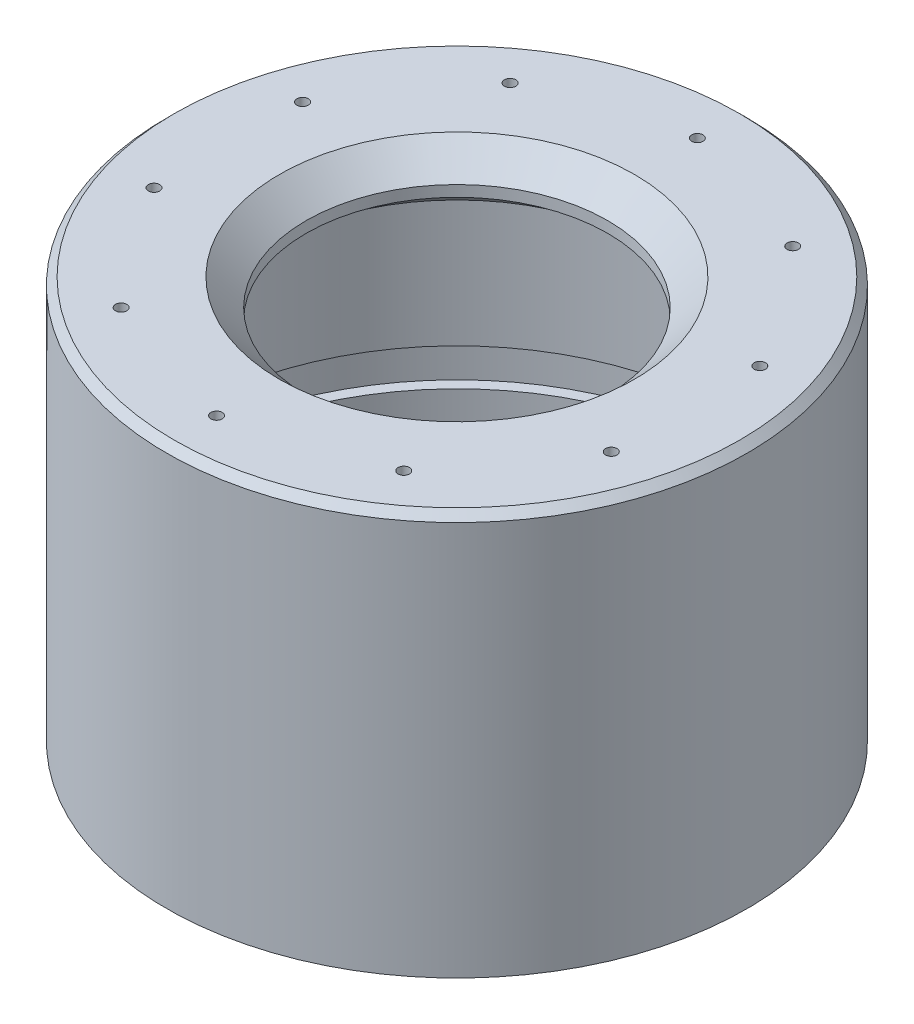
ISO-10303-21;
HEADER;
FILE_DESCRIPTION(('STEP AP214'),'2;1');
FILE_NAME('part.step','',(''),(''),'','','');
FILE_SCHEMA(('AUTOMOTIVE_DESIGN { 1 0 10303 214 1 1 1 1 }'));
ENDSEC;
DATA;
#1=APPLICATION_CONTEXT('core data for automotive mechanical design processes');
#2=APPLICATION_PROTOCOL_DEFINITION('international standard','automotive_design',2000,#1);
#3=PRODUCT_CONTEXT('',#1,'mechanical');
#4=PRODUCT('Part','Part','',(#3));
#5=PRODUCT_RELATED_PRODUCT_CATEGORY('part','',(#4));
#6=PRODUCT_DEFINITION_FORMATION('','',#4);
#7=PRODUCT_DEFINITION_CONTEXT('part definition',#1,'design');
#8=PRODUCT_DEFINITION('design','',#6,#7);
#9=PRODUCT_DEFINITION_SHAPE('','',#8);
#10=(LENGTH_UNIT() NAMED_UNIT(*) SI_UNIT(.MILLI.,.METRE.));
#11=(NAMED_UNIT(*) PLANE_ANGLE_UNIT() SI_UNIT($,.RADIAN.));
#12=(NAMED_UNIT(*) SI_UNIT($,.STERADIAN.) SOLID_ANGLE_UNIT());
#13=UNCERTAINTY_MEASURE_WITH_UNIT(LENGTH_MEASURE(1.E-05),#10,'distance_accuracy_value','');
#14=(GEOMETRIC_REPRESENTATION_CONTEXT(3) GLOBAL_UNCERTAINTY_ASSIGNED_CONTEXT((#13)) GLOBAL_UNIT_ASSIGNED_CONTEXT((#10,
#11,#12)) REPRESENTATION_CONTEXT('',''));
#15=CARTESIAN_POINT('',(0.,0.,0.));
#16=DIRECTION('',(0.,0.,1.));
#17=DIRECTION('',(1.,0.,0.));
#18=AXIS2_PLACEMENT_3D('',#15,#16,#17);
#19=CARTESIAN_POINT('',(20.7627899962036,106.6,51.5748333914028));
#20=DIRECTION('',(0.,-1.,0.));
#21=DIRECTION('',(0.,0.,-1.));
#22=AXIS2_PLACEMENT_3D('',#19,#20,#21);
#23=CYLINDRICAL_SURFACE('',#22,1.5);
#24=CARTESIAN_POINT('',(20.7627899962036,106.6,51.5748333914028));
#25=DIRECTION('',(0.,-1.,0.));
#26=DIRECTION('',(0.587785252292474,0.,-0.809016994374947));
#27=AXIS2_PLACEMENT_3D('',#24,#25,#26);
#28=CIRCLE('',#27,1.5);
#29=CARTESIAN_POINT('',(21.6444678746423,106.6,50.3613078998404));
#30=VERTEX_POINT('',#29);
#31=EDGE_CURVE('E124',#30,#30,#28,.T.);
#32=ORIENTED_EDGE('',*,*,#31,.F.);
#33=EDGE_LOOP('',(#32));
#34=FACE_BOUND('',#33,.T.);
#35=CARTESIAN_POINT('',(20.7627899962036,99.6,51.5748333914028));
#36=DIRECTION('',(0.,-1.,0.));
#37=DIRECTION('',(0.587785252292474,0.,-0.809016994374947));
#38=AXIS2_PLACEMENT_3D('',#35,#36,#37);
#39=CIRCLE('',#38,1.5);
#40=CARTESIAN_POINT('',(21.6444678746423,99.6,50.3613078998404));
#41=VERTEX_POINT('',#40);
#42=EDGE_CURVE('E165',#41,#41,#39,.T.);
#43=ORIENTED_EDGE('',*,*,#42,.T.);
#44=EDGE_LOOP('',(#43));
#45=FACE_BOUND('',#44,.T.);
#46=ADVANCED_FACE('F36',(#34,#45),#23,.F.);
#47=CARTESIAN_POINT('',(-2.39575308396724,106.6,19.6998333914027));
#48=DIRECTION('',(0.,-1.,0.));
#49=DIRECTION('',(0.,0.,-1.));
#50=AXIS2_PLACEMENT_3D('',#47,#48,#49);
#51=CYLINDRICAL_SURFACE('',#50,1.5);
#52=CARTESIAN_POINT('',(-2.39575308396724,106.6,19.6998333914027));
#53=DIRECTION('',(0.,-1.,0.));
#54=DIRECTION('',(0.951056516295155,0.,-0.309016994374945));
#55=AXIS2_PLACEMENT_3D('',#52,#53,#54);
#56=CIRCLE('',#55,1.5);
#57=CARTESIAN_POINT('',(-0.969168309524507,106.6,19.2363078998403));
#58=VERTEX_POINT('',#57);
#59=EDGE_CURVE('E128',#58,#58,#56,.T.);
#60=ORIENTED_EDGE('',*,*,#59,.F.);
#61=EDGE_LOOP('',(#60));
#62=FACE_BOUND('',#61,.T.);
#63=CARTESIAN_POINT('',(-2.39575308396724,99.6,19.6998333914027));
#64=DIRECTION('',(0.,-1.,0.));
#65=DIRECTION('',(0.951056516295155,0.,-0.309016994374945));
#66=AXIS2_PLACEMENT_3D('',#63,#64,#65);
#67=CIRCLE('',#66,1.5);
#68=CARTESIAN_POINT('',(-0.969168309524507,99.6,19.2363078998403));
#69=VERTEX_POINT('',#68);
#70=EDGE_CURVE('E254',#69,#69,#67,.T.);
#71=ORIENTED_EDGE('',*,*,#70,.T.);
#72=EDGE_LOOP('',(#71));
#73=FACE_BOUND('',#72,.T.);
#74=ADVANCED_FACE('F269',(#62,#73),#51,.F.);
#75=CARTESIAN_POINT('',(-2.3957530839671,106.6,-19.6998333914032));
#76=DIRECTION('',(0.,-1.,0.));
#77=DIRECTION('',(0.,0.,-1.));
#78=AXIS2_PLACEMENT_3D('',#75,#76,#77);
#79=CYLINDRICAL_SURFACE('',#78,1.5);
#80=CARTESIAN_POINT('',(-2.3957530839671,106.6,-19.6998333914032));
#81=DIRECTION('',(0.,-1.,0.));
#82=DIRECTION('',(0.951056516295152,0.,0.309016994374952));
#83=AXIS2_PLACEMENT_3D('',#80,#81,#82);
#84=CIRCLE('',#83,1.5);
#85=CARTESIAN_POINT('',(-0.969168309524365,106.6,-19.2363078998407));
#86=VERTEX_POINT('',#85);
#87=EDGE_CURVE('E154',#86,#86,#84,.T.);
#88=ORIENTED_EDGE('',*,*,#87,.F.);
#89=EDGE_LOOP('',(#88));
#90=FACE_BOUND('',#89,.T.);
#91=CARTESIAN_POINT('',(-2.3957530839671,99.6,-19.6998333914032));
#92=DIRECTION('',(0.,-1.,0.));
#93=DIRECTION('',(0.951056516295152,0.,0.309016994374952));
#94=AXIS2_PLACEMENT_3D('',#91,#92,#93);
#95=CIRCLE('',#94,1.5);
#96=CARTESIAN_POINT('',(-0.969168309524365,99.6,-19.2363078998407));
#97=VERTEX_POINT('',#96);
#98=EDGE_CURVE('E242',#97,#97,#95,.T.);
#99=ORIENTED_EDGE('',*,*,#98,.T.);
#100=EDGE_LOOP('',(#99));
#101=FACE_BOUND('',#100,.T.);
#102=ADVANCED_FACE('F351',(#90,#101),#79,.F.);
#103=CARTESIAN_POINT('',(20.762789996204,106.6,-51.5748333914031));
#104=DIRECTION('',(0.,-1.,0.));
#105=DIRECTION('',(0.,0.,-1.));
#106=AXIS2_PLACEMENT_3D('',#103,#104,#105);
#107=CYLINDRICAL_SURFACE('',#106,1.5);
#108=CARTESIAN_POINT('',(20.762789996204,106.6,-51.5748333914031));
#109=DIRECTION('',(0.,-1.,0.));
#110=DIRECTION('',(0.587785252292469,0.,0.809016994374951));
#111=AXIS2_PLACEMENT_3D('',#108,#109,#110);
#112=CIRCLE('',#111,1.5);
#113=CARTESIAN_POINT('',(21.6444678746427,106.6,-50.3613078998407));
#114=VERTEX_POINT('',#113);
#115=EDGE_CURVE('E150',#114,#114,#112,.T.);
#116=ORIENTED_EDGE('',*,*,#115,.F.);
#117=EDGE_LOOP('',(#116));
#118=FACE_BOUND('',#117,.T.);
#119=CARTESIAN_POINT('',(20.762789996204,99.6,-51.5748333914031));
#120=DIRECTION('',(0.,-1.,0.));
#121=DIRECTION('',(0.587785252292469,0.,0.809016994374951));
#122=AXIS2_PLACEMENT_3D('',#119,#120,#121);
#123=CIRCLE('',#122,1.5);
#124=CARTESIAN_POINT('',(21.6444678746427,99.6,-50.3613078998407));
#125=VERTEX_POINT('',#124);
#126=EDGE_CURVE('E230',#125,#125,#123,.T.);
#127=ORIENTED_EDGE('',*,*,#126,.T.);
#128=EDGE_LOOP('',(#127));
#129=FACE_BOUND('',#128,.T.);
#130=ADVANCED_FACE('F617',(#118,#129),#107,.F.);
#131=CARTESIAN_POINT('',(58.2340998298489,106.6,-63.75));
#132=DIRECTION('',(0.,-1.,0.));
#133=DIRECTION('',(0.,0.,-1.));
#134=AXIS2_PLACEMENT_3D('',#131,#132,#133);
#135=CYLINDRICAL_SURFACE('',#134,1.5);
#136=CARTESIAN_POINT('',(58.2340998298489,106.6,-63.75));
#137=DIRECTION('',(0.,-1.,0.));
#138=DIRECTION('',(0.,0.,1.));
#139=AXIS2_PLACEMENT_3D('',#136,#137,#138);
#140=CIRCLE('',#139,1.5);
#141=CARTESIAN_POINT('',(58.2340998298489,106.6,-62.25));
#142=VERTEX_POINT('',#141);
#143=EDGE_CURVE('E146',#142,#142,#140,.T.);
#144=ORIENTED_EDGE('',*,*,#143,.F.);
#145=EDGE_LOOP('',(#144));
#146=FACE_BOUND('',#145,.T.);
#147=CARTESIAN_POINT('',(58.2340998298489,99.6,-63.75));
#148=DIRECTION('',(0.,-1.,0.));
#149=DIRECTION('',(0.,0.,1.));
#150=AXIS2_PLACEMENT_3D('',#147,#148,#149);
#151=CIRCLE('',#150,1.5);
#152=CARTESIAN_POINT('',(58.2340998298489,99.6,-62.25));
#153=VERTEX_POINT('',#152);
#154=EDGE_CURVE('E218',#153,#153,#151,.T.);
#155=ORIENTED_EDGE('',*,*,#154,.T.);
#156=EDGE_LOOP('',(#155));
#157=FACE_BOUND('',#156,.T.);
#158=ADVANCED_FACE('F626',(#146,#157),#135,.F.);
#159=CARTESIAN_POINT('',(95.7054096634945,106.6,-51.5748333914026));
#160=DIRECTION('',(0.,-1.,0.));
#161=DIRECTION('',(0.,0.,-1.));
#162=AXIS2_PLACEMENT_3D('',#159,#160,#161);
#163=CYLINDRICAL_SURFACE('',#162,1.5);
#164=CARTESIAN_POINT('',(95.7054096634945,106.6,-51.5748333914026));
#165=DIRECTION('',(0.,-1.,0.));
#166=DIRECTION('',(-0.58778525229248,0.,0.809016994374942));
#167=AXIS2_PLACEMENT_3D('',#164,#165,#166);
#168=CIRCLE('',#167,1.5);
#169=CARTESIAN_POINT('',(94.8237317850558,106.6,-50.3613078998401));
#170=VERTEX_POINT('',#169);
#171=EDGE_CURVE('E142',#170,#170,#168,.T.);
#172=ORIENTED_EDGE('',*,*,#171,.F.);
#173=EDGE_LOOP('',(#172));
#174=FACE_BOUND('',#173,.T.);
#175=CARTESIAN_POINT('',(95.7054096634945,99.6,-51.5748333914026));
#176=DIRECTION('',(0.,-1.,0.));
#177=DIRECTION('',(-0.58778525229248,0.,0.809016994374942));
#178=AXIS2_PLACEMENT_3D('',#175,#176,#177);
#179=CIRCLE('',#178,1.5);
#180=CARTESIAN_POINT('',(94.8237317850558,99.6,-50.3613078998401));
#181=VERTEX_POINT('',#180);
#182=EDGE_CURVE('E206',#181,#181,#179,.T.);
#183=ORIENTED_EDGE('',*,*,#182,.T.);
#184=EDGE_LOOP('',(#183));
#185=FACE_BOUND('',#184,.T.);
#186=ADVANCED_FACE('F635',(#174,#185),#163,.F.);
#187=CARTESIAN_POINT('',(118.863952743665,106.6,-19.6998333914023));
#188=DIRECTION('',(0.,-1.,0.));
#189=DIRECTION('',(0.,0.,-1.));
#190=AXIS2_PLACEMENT_3D('',#187,#188,#189);
#191=CYLINDRICAL_SURFACE('',#190,1.5);
#192=CARTESIAN_POINT('',(118.863952743665,106.6,-19.6998333914023));
#193=DIRECTION('',(0.,-1.,0.));
#194=DIRECTION('',(-0.951056516295157,0.,0.309016994374938));
#195=AXIS2_PLACEMENT_3D('',#192,#193,#194);
#196=CIRCLE('',#195,1.5);
#197=CARTESIAN_POINT('',(117.437367969222,106.6,-19.2363078998399));
#198=VERTEX_POINT('',#197);
#199=EDGE_CURVE('E138',#198,#198,#196,.T.);
#200=ORIENTED_EDGE('',*,*,#199,.F.);
#201=EDGE_LOOP('',(#200));
#202=FACE_BOUND('',#201,.T.);
#203=CARTESIAN_POINT('',(118.863952743665,99.6,-19.6998333914023));
#204=DIRECTION('',(0.,-1.,0.));
#205=DIRECTION('',(-0.951056516295157,0.,0.309016994374938));
#206=AXIS2_PLACEMENT_3D('',#203,#204,#205);
#207=CIRCLE('',#206,1.5);
#208=CARTESIAN_POINT('',(117.437367969222,99.6,-19.2363078998399));
#209=VERTEX_POINT('',#208);
#210=EDGE_CURVE('E194',#209,#209,#207,.T.);
#211=ORIENTED_EDGE('',*,*,#210,.T.);
#212=EDGE_LOOP('',(#211));
#213=FACE_BOUND('',#212,.T.);
#214=ADVANCED_FACE('F644',(#202,#213),#191,.F.);
#215=CARTESIAN_POINT('',(118.863952743665,106.6,19.6998333914036));
#216=DIRECTION('',(0.,-1.,0.));
#217=DIRECTION('',(0.,0.,-1.));
#218=AXIS2_PLACEMENT_3D('',#215,#216,#217);
#219=CYLINDRICAL_SURFACE('',#218,1.5);
#220=CARTESIAN_POINT('',(118.863952743665,106.6,19.6998333914036));
#221=DIRECTION('',(0.,-1.,0.));
#222=DIRECTION('',(-0.95105651629515,0.,-0.309016994374958));
#223=AXIS2_PLACEMENT_3D('',#220,#221,#222);
#224=CIRCLE('',#223,1.5);
#225=CARTESIAN_POINT('',(117.437367969222,106.6,19.2363078998412));
#226=VERTEX_POINT('',#225);
#227=EDGE_CURVE('E133',#226,#226,#224,.T.);
#228=ORIENTED_EDGE('',*,*,#227,.F.);
#229=EDGE_LOOP('',(#228));
#230=FACE_BOUND('',#229,.T.);
#231=CARTESIAN_POINT('',(118.863952743665,99.6,19.6998333914036));
#232=DIRECTION('',(0.,-1.,0.));
#233=DIRECTION('',(-0.95105651629515,0.,-0.309016994374958));
#234=AXIS2_PLACEMENT_3D('',#231,#232,#233);
#235=CIRCLE('',#234,1.5);
#236=CARTESIAN_POINT('',(117.437367969222,99.6,19.2363078998412));
#237=VERTEX_POINT('',#236);
#238=EDGE_CURVE('E182',#237,#237,#235,.T.);
#239=ORIENTED_EDGE('',*,*,#238,.T.);
#240=EDGE_LOOP('',(#239));
#241=FACE_BOUND('',#240,.T.);
#242=ADVANCED_FACE('F653',(#230,#241),#219,.F.);
#243=CARTESIAN_POINT('',(95.7054096634934,106.6,51.5748333914034));
#244=DIRECTION('',(0.,-1.,0.));
#245=DIRECTION('',(0.,0.,-1.));
#246=AXIS2_PLACEMENT_3D('',#243,#244,#245);
#247=CYLINDRICAL_SURFACE('',#246,1.5);
#248=CARTESIAN_POINT('',(95.7054096634934,106.6,51.5748333914034));
#249=DIRECTION('',(0.,-1.,0.));
#250=DIRECTION('',(-0.587785252292462,0.,-0.809016994374955));
#251=AXIS2_PLACEMENT_3D('',#248,#249,#250);
#252=CIRCLE('',#251,1.5);
#253=CARTESIAN_POINT('',(94.8237317850547,106.6,50.361307899841));
#254=VERTEX_POINT('',#253);
#255=EDGE_CURVE('E129',#254,#254,#252,.T.);
#256=ORIENTED_EDGE('',*,*,#255,.F.);
#257=EDGE_LOOP('',(#256));
#258=FACE_BOUND('',#257,.T.);
#259=CARTESIAN_POINT('',(95.7054096634934,99.6,51.5748333914034));
#260=DIRECTION('',(0.,-1.,0.));
#261=DIRECTION('',(-0.587785252292462,0.,-0.809016994374955));
#262=AXIS2_PLACEMENT_3D('',#259,#260,#261);
#263=CIRCLE('',#262,1.5);
#264=CARTESIAN_POINT('',(94.8237317850547,99.6,50.361307899841));
#265=VERTEX_POINT('',#264);
#266=EDGE_CURVE('E178',#265,#265,#263,.T.);
#267=ORIENTED_EDGE('',*,*,#266,.T.);
#268=EDGE_LOOP('',(#267));
#269=FACE_BOUND('',#268,.T.);
#270=ADVANCED_FACE('F358',(#258,#269),#247,.F.);
#271=CARTESIAN_POINT('',(58.2340998298489,106.6,63.75));
#272=DIRECTION('',(0.,-1.,0.));
#273=DIRECTION('',(0.,0.,-1.));
#274=AXIS2_PLACEMENT_3D('',#271,#272,#273);
#275=CYLINDRICAL_SURFACE('',#274,1.5);
#276=CARTESIAN_POINT('',(58.2340998298489,106.6,63.75));
#277=DIRECTION('',(0.,-1.,0.));
#278=DIRECTION('',(0.,0.,-1.));
#279=AXIS2_PLACEMENT_3D('',#276,#277,#278);
#280=CIRCLE('',#279,1.5);
#281=CARTESIAN_POINT('',(58.2340998298489,106.6,62.25));
#282=VERTEX_POINT('',#281);
#283=EDGE_CURVE('E108',#282,#282,#280,.T.);
#284=ORIENTED_EDGE('',*,*,#283,.F.);
#285=EDGE_LOOP('',(#284));
#286=FACE_BOUND('',#285,.T.);
#287=CARTESIAN_POINT('',(58.2340998298489,99.6,63.75));
#288=DIRECTION('',(0.,-1.,0.));
#289=DIRECTION('',(0.,0.,-1.));
#290=AXIS2_PLACEMENT_3D('',#287,#288,#289);
#291=CIRCLE('',#290,1.5);
#292=CARTESIAN_POINT('',(58.2340998298489,99.6,62.25));
#293=VERTEX_POINT('',#292);
#294=EDGE_CURVE('E117',#293,#293,#291,.T.);
#295=ORIENTED_EDGE('',*,*,#294,.T.);
#296=EDGE_LOOP('',(#295));
#297=FACE_BOUND('',#296,.T.);
#298=ADVANCED_FACE('F370',(#286,#297),#275,.F.);
#299=CARTESIAN_POINT('',(58.2340998298489,99.5289321881346,0.));
#300=DIRECTION('',(0.,1.,0.));
#301=DIRECTION('',(0.,0.,1.));
#302=AXIS2_PLACEMENT_3D('',#299,#300,#301);
#303=CONICAL_SURFACE('',#302,40.,0.785398163397454);
#304=CARTESIAN_POINT('',(58.2340998298489,106.6,0.));
#305=DIRECTION('',(0.,-1.,0.));
#306=DIRECTION('',(0.,0.,-1.));
#307=AXIS2_PLACEMENT_3D('',#304,#305,#306);
#308=CIRCLE('',#307,47.0710678118655);
#309=CARTESIAN_POINT('',(58.2340998298489,106.6,-47.0710678118655));
#310=VERTEX_POINT('',#309);
#311=EDGE_CURVE('E49',#310,#310,#308,.T.);
#312=ORIENTED_EDGE('',*,*,#311,.F.);
#313=EDGE_LOOP('',(#312));
#314=FACE_BOUND('',#313,.T.);
#315=CARTESIAN_POINT('',(58.2340998298489,99.5289321881346,0.));
#316=DIRECTION('',(0.,-1.,0.));
#317=DIRECTION('',(0.,0.,-1.));
#318=AXIS2_PLACEMENT_3D('',#315,#316,#317);
#319=CIRCLE('',#318,40.);
#320=CARTESIAN_POINT('',(58.2340998298489,99.5289321881346,-40.));
#321=VERTEX_POINT('',#320);
#322=EDGE_CURVE('E104',#321,#321,#319,.T.);
#323=ORIENTED_EDGE('',*,*,#322,.T.);
#324=EDGE_LOOP('',(#323));
#325=FACE_BOUND('',#324,.T.);
#326=ADVANCED_FACE('F343',(#314,#325),#303,.F.);
#327=CARTESIAN_POINT('',(11.1630320179834,106.6,0.));
#328=DIRECTION('',(0.,-1.,0.));
#329=DIRECTION('',(0.,0.,-1.));
#330=AXIS2_PLACEMENT_3D('',#327,#328,#329);
#331=PLANE('',#330);
#332=CARTESIAN_POINT('',(58.2340998298489,106.6,0.));
#333=DIRECTION('',(0.,-1.,0.));
#334=DIRECTION('',(0.,0.,-1.));
#335=AXIS2_PLACEMENT_3D('',#332,#333,#334);
#336=CIRCLE('',#335,74.9840998298489);
#337=CARTESIAN_POINT('',(58.2340998298489,106.6,-74.9840998298489));
#338=VERTEX_POINT('',#337);
#339=EDGE_CURVE('E10',#338,#338,#336,.F.);
#340=ORIENTED_EDGE('',*,*,#339,.T.);
#341=EDGE_LOOP('',(#340));
#342=FACE_BOUND('',#341,.T.);
#343=ORIENTED_EDGE('',*,*,#255,.T.);
#344=EDGE_LOOP('',(#343));
#345=FACE_BOUND('',#344,.T.);
#346=ORIENTED_EDGE('',*,*,#227,.T.);
#347=EDGE_LOOP('',(#346));
#348=FACE_BOUND('',#347,.T.);
#349=ORIENTED_EDGE('',*,*,#199,.T.);
#350=EDGE_LOOP('',(#349));
#351=FACE_BOUND('',#350,.T.);
#352=ORIENTED_EDGE('',*,*,#171,.T.);
#353=EDGE_LOOP('',(#352));
#354=FACE_BOUND('',#353,.T.);
#355=ORIENTED_EDGE('',*,*,#143,.T.);
#356=EDGE_LOOP('',(#355));
#357=FACE_BOUND('',#356,.T.);
#358=ORIENTED_EDGE('',*,*,#115,.T.);
#359=EDGE_LOOP('',(#358));
#360=FACE_BOUND('',#359,.T.);
#361=ORIENTED_EDGE('',*,*,#87,.T.);
#362=EDGE_LOOP('',(#361));
#363=FACE_BOUND('',#362,.T.);
#364=ORIENTED_EDGE('',*,*,#59,.T.);
#365=EDGE_LOOP('',(#364));
#366=FACE_BOUND('',#365,.T.);
#367=ORIENTED_EDGE('',*,*,#31,.T.);
#368=EDGE_LOOP('',(#367));
#369=FACE_BOUND('',#368,.T.);
#370=ORIENTED_EDGE('',*,*,#283,.T.);
#371=EDGE_LOOP('',(#370));
#372=FACE_BOUND('',#371,.T.);
#373=ORIENTED_EDGE('',*,*,#311,.T.);
#374=EDGE_LOOP('',(#373));
#375=FACE_BOUND('',#374,.T.);
#376=ADVANCED_FACE('F337',(#342,#345,#348,#351,#354,#357,#360,#363,#366,#369,#372,#375),#331,.F.);
#377=CARTESIAN_POINT('',(58.2340998298489,90.1719634232009,0.));
#378=DIRECTION('',(0.,-1.,0.));
#379=DIRECTION('',(0.,0.,-1.));
#380=AXIS2_PLACEMENT_3D('',#377,#378,#379);
#381=CYLINDRICAL_SURFACE('',#380,76.9840998298489);
#382=CARTESIAN_POINT('',(58.2340998298489,104.6,0.));
#383=DIRECTION('',(0.,-1.,0.));
#384=DIRECTION('',(0.,0.,-1.));
#385=AXIS2_PLACEMENT_3D('',#382,#383,#384);
#386=CIRCLE('',#385,76.9840998298489);
#387=CARTESIAN_POINT('',(58.2340998298489,104.6,-76.9840998298489));
#388=VERTEX_POINT('',#387);
#389=EDGE_CURVE('E44',#388,#388,#386,.T.);
#390=ORIENTED_EDGE('',*,*,#389,.T.);
#391=EDGE_LOOP('',(#390));
#392=FACE_BOUND('',#391,.T.);
#393=CARTESIAN_POINT('',(58.2340998298489,0.,0.));
#394=DIRECTION('',(0.,-1.,0.));
#395=DIRECTION('',(0.,0.,-1.));
#396=AXIS2_PLACEMENT_3D('',#393,#394,#395);
#397=CIRCLE('',#396,76.9840998298489);
#398=CARTESIAN_POINT('',(58.2340998298489,0.,-76.9840998298489));
#399=VERTEX_POINT('',#398);
#400=EDGE_CURVE('E54',#399,#399,#397,.T.);
#401=ORIENTED_EDGE('',*,*,#400,.F.);
#402=EDGE_LOOP('',(#401));
#403=FACE_BOUND('',#402,.T.);
#404=ADVANCED_FACE('F332',(#392,#403),#381,.T.);
#405=CARTESIAN_POINT('',(-13.75,0.,0.));
#406=DIRECTION('',(0.,1.,0.));
#407=DIRECTION('',(0.,0.,1.));
#408=AXIS2_PLACEMENT_3D('',#405,#406,#407);
#409=PLANE('',#408);
#410=CARTESIAN_POINT('',(58.2340998298489,0.,0.));
#411=DIRECTION('',(0.,-1.,0.));
#412=DIRECTION('',(0.,0.,-1.));
#413=AXIS2_PLACEMENT_3D('',#410,#411,#412);
#414=CIRCLE('',#413,71.9840998298489);
#415=CARTESIAN_POINT('',(58.2340998298489,0.,-71.9840998298489));
#416=VERTEX_POINT('',#415);
#417=EDGE_CURVE('E60',#416,#416,#414,.T.);
#418=ORIENTED_EDGE('',*,*,#417,.F.);
#419=EDGE_LOOP('',(#418));
#420=FACE_BOUND('',#419,.T.);
#421=ORIENTED_EDGE('',*,*,#400,.T.);
#422=EDGE_LOOP('',(#421));
#423=FACE_BOUND('',#422,.T.);
#424=ADVANCED_FACE('F326',(#420,#423),#409,.F.);
#425=CARTESIAN_POINT('',(58.2340998298489,90.1719634232009,0.));
#426=DIRECTION('',(0.,-1.,0.));
#427=DIRECTION('',(0.,0.,-1.));
#428=AXIS2_PLACEMENT_3D('',#425,#426,#427);
#429=CYLINDRICAL_SURFACE('',#428,71.9840998298489);
#430=CARTESIAN_POINT('',(58.2340998298489,30.,0.));
#431=DIRECTION('',(0.,-1.,0.));
#432=DIRECTION('',(0.,0.,-1.));
#433=AXIS2_PLACEMENT_3D('',#430,#431,#432);
#434=CIRCLE('',#433,71.9840998298489);
#435=CARTESIAN_POINT('',(58.2340998298489,30.,-71.9840998298489));
#436=VERTEX_POINT('',#435);
#437=EDGE_CURVE('E64',#436,#436,#434,.T.);
#438=ORIENTED_EDGE('',*,*,#437,.F.);
#439=EDGE_LOOP('',(#438));
#440=FACE_BOUND('',#439,.T.);
#441=ORIENTED_EDGE('',*,*,#417,.T.);
#442=EDGE_LOOP('',(#441));
#443=FACE_BOUND('',#442,.T.);
#444=ADVANCED_FACE('F320',(#440,#443),#429,.F.);
#445=CARTESIAN_POINT('',(-16.6611436861217,30.,0.));
#446=DIRECTION('',(0.,-1.,0.));
#447=DIRECTION('',(0.,0.,-1.));
#448=AXIS2_PLACEMENT_3D('',#445,#446,#447);
#449=PLANE('',#448);
#450=CARTESIAN_POINT('',(58.2340998298489,30.,0.));
#451=DIRECTION('',(0.,-1.,0.));
#452=DIRECTION('',(0.,0.,-1.));
#453=AXIS2_PLACEMENT_3D('',#450,#451,#452);
#454=CIRCLE('',#453,74.8952435159706);
#455=CARTESIAN_POINT('',(58.2340998298489,30.,-74.8952435159706));
#456=VERTEX_POINT('',#455);
#457=EDGE_CURVE('E68',#456,#456,#454,.T.);
#458=ORIENTED_EDGE('',*,*,#457,.F.);
#459=EDGE_LOOP('',(#458));
#460=FACE_BOUND('',#459,.T.);
#461=ORIENTED_EDGE('',*,*,#437,.T.);
#462=EDGE_LOOP('',(#461));
#463=FACE_BOUND('',#462,.T.);
#464=ADVANCED_FACE('F314',(#460,#463),#449,.F.);
#465=CARTESIAN_POINT('',(58.2340998298489,90.1719634232009,0.));
#466=DIRECTION('',(0.,-1.,0.));
#467=DIRECTION('',(0.,0.,-1.));
#468=AXIS2_PLACEMENT_3D('',#465,#466,#467);
#469=CYLINDRICAL_SURFACE('',#468,74.8952435159706);
#470=CARTESIAN_POINT('',(58.2340998298489,39.8655155741767,0.));
#471=DIRECTION('',(0.,-1.,0.));
#472=DIRECTION('',(0.,0.,-1.));
#473=AXIS2_PLACEMENT_3D('',#470,#471,#472);
#474=CIRCLE('',#473,74.8952435159706);
#475=CARTESIAN_POINT('',(58.2340998298489,39.8655155741767,-74.8952435159706));
#476=VERTEX_POINT('',#475);
#477=EDGE_CURVE('E72',#476,#476,#474,.T.);
#478=ORIENTED_EDGE('',*,*,#477,.F.);
#479=EDGE_LOOP('',(#478));
#480=FACE_BOUND('',#479,.T.);
#481=ORIENTED_EDGE('',*,*,#457,.T.);
#482=EDGE_LOOP('',(#481));
#483=FACE_BOUND('',#482,.T.);
#484=ADVANCED_FACE('F308',(#480,#483),#469,.F.);
#485=CARTESIAN_POINT('',(-13.75,39.8655155741767,0.));
#486=DIRECTION('',(0.,1.,0.));
#487=DIRECTION('',(0.,0.,1.));
#488=AXIS2_PLACEMENT_3D('',#485,#486,#487);
#489=PLANE('',#488);
#490=CARTESIAN_POINT('',(58.2340998298489,39.8655155741767,0.));
#491=DIRECTION('',(0.,-1.,0.));
#492=DIRECTION('',(0.,0.,-1.));
#493=AXIS2_PLACEMENT_3D('',#490,#491,#492);
#494=CIRCLE('',#493,71.9840998298489);
#495=CARTESIAN_POINT('',(58.2340998298489,39.8655155741767,-71.9840998298489));
#496=VERTEX_POINT('',#495);
#497=EDGE_CURVE('E76',#496,#496,#494,.T.);
#498=ORIENTED_EDGE('',*,*,#497,.F.);
#499=EDGE_LOOP('',(#498));
#500=FACE_BOUND('',#499,.T.);
#501=ORIENTED_EDGE('',*,*,#477,.T.);
#502=EDGE_LOOP('',(#501));
#503=FACE_BOUND('',#502,.T.);
#504=ADVANCED_FACE('F302',(#500,#503),#489,.F.);
#505=CARTESIAN_POINT('',(58.2340998298489,90.1719634232009,0.));
#506=DIRECTION('',(0.,-1.,0.));
#507=DIRECTION('',(0.,0.,-1.));
#508=AXIS2_PLACEMENT_3D('',#505,#506,#507);
#509=CYLINDRICAL_SURFACE('',#508,71.9840998298489);
#510=CARTESIAN_POINT('',(58.2340998298489,96.6,0.));
#511=DIRECTION('',(0.,-1.,0.));
#512=DIRECTION('',(0.,0.,-1.));
#513=AXIS2_PLACEMENT_3D('',#510,#511,#512);
#514=CIRCLE('',#513,71.9840998298489);
#515=CARTESIAN_POINT('',(58.2340998298489,96.6,-71.9840998298489));
#516=VERTEX_POINT('',#515);
#517=EDGE_CURVE('E80',#516,#516,#514,.T.);
#518=ORIENTED_EDGE('',*,*,#517,.F.);
#519=EDGE_LOOP('',(#518));
#520=FACE_BOUND('',#519,.T.);
#521=ORIENTED_EDGE('',*,*,#497,.T.);
#522=EDGE_LOOP('',(#521));
#523=FACE_BOUND('',#522,.T.);
#524=ADVANCED_FACE('F289',(#520,#523),#509,.F.);
#525=CARTESIAN_POINT('',(3.23409982984887,96.6,0.));
#526=DIRECTION('',(0.,1.,0.));
#527=DIRECTION('',(0.,0.,1.));
#528=AXIS2_PLACEMENT_3D('',#525,#526,#527);
#529=PLANE('',#528);
#530=CARTESIAN_POINT('',(95.7054096634934,96.6,51.5748333914034));
#531=DIRECTION('',(0.,-1.,0.));
#532=DIRECTION('',(-0.587785252292462,0.,-0.809016994374955));
#533=AXIS2_PLACEMENT_3D('',#530,#531,#532);
#534=CIRCLE('',#533,3.);
#535=CARTESIAN_POINT('',(93.942053906616,96.6,49.1477824082785));
#536=VERTEX_POINT('',#535);
#537=EDGE_CURVE('E173',#536,#536,#534,.T.);
#538=ORIENTED_EDGE('',*,*,#537,.F.);
#539=EDGE_LOOP('',(#538));
#540=FACE_BOUND('',#539,.T.);
#541=CARTESIAN_POINT('',(118.863952743665,96.6,19.6998333914036));
#542=DIRECTION('',(0.,-1.,0.));
#543=DIRECTION('',(-0.95105651629515,0.,-0.309016994374958));
#544=AXIS2_PLACEMENT_3D('',#541,#542,#543);
#545=CIRCLE('',#544,3.);
#546=CARTESIAN_POINT('',(116.010783194779,96.6,18.7727824082787));
#547=VERTEX_POINT('',#546);
#548=EDGE_CURVE('E186',#547,#547,#545,.T.);
#549=ORIENTED_EDGE('',*,*,#548,.F.);
#550=EDGE_LOOP('',(#549));
#551=FACE_BOUND('',#550,.T.);
#552=CARTESIAN_POINT('',(118.863952743665,96.6,-19.6998333914023));
#553=DIRECTION('',(0.,-1.,0.));
#554=DIRECTION('',(-0.951056516295157,0.,0.309016994374938));
#555=AXIS2_PLACEMENT_3D('',#552,#553,#554);
#556=CIRCLE('',#555,3.);
#557=CARTESIAN_POINT('',(116.01078319478,96.6,-18.7727824082775));
#558=VERTEX_POINT('',#557);
#559=EDGE_CURVE('E198',#558,#558,#556,.T.);
#560=ORIENTED_EDGE('',*,*,#559,.F.);
#561=EDGE_LOOP('',(#560));
#562=FACE_BOUND('',#561,.T.);
#563=CARTESIAN_POINT('',(95.7054096634945,96.6,-51.5748333914026));
#564=DIRECTION('',(0.,-1.,0.));
#565=DIRECTION('',(-0.58778525229248,0.,0.809016994374942));
#566=AXIS2_PLACEMENT_3D('',#563,#564,#565);
#567=CIRCLE('',#566,3.);
#568=CARTESIAN_POINT('',(93.942053906617,96.6,-49.1477824082777));
#569=VERTEX_POINT('',#568);
#570=EDGE_CURVE('E210',#569,#569,#567,.T.);
#571=ORIENTED_EDGE('',*,*,#570,.F.);
#572=EDGE_LOOP('',(#571));
#573=FACE_BOUND('',#572,.T.);
#574=CARTESIAN_POINT('',(58.2340998298489,96.6,-63.75));
#575=DIRECTION('',(0.,-1.,0.));
#576=DIRECTION('',(0.,0.,1.));
#577=AXIS2_PLACEMENT_3D('',#574,#575,#576);
#578=CIRCLE('',#577,3.);
#579=CARTESIAN_POINT('',(58.2340998298489,96.6,-60.75));
#580=VERTEX_POINT('',#579);
#581=EDGE_CURVE('E222',#580,#580,#578,.T.);
#582=ORIENTED_EDGE('',*,*,#581,.F.);
#583=EDGE_LOOP('',(#582));
#584=FACE_BOUND('',#583,.T.);
#585=CARTESIAN_POINT('',(20.762789996204,96.6,-51.5748333914031));
#586=DIRECTION('',(0.,-1.,0.));
#587=DIRECTION('',(0.587785252292469,0.,0.809016994374951));
#588=AXIS2_PLACEMENT_3D('',#585,#586,#587);
#589=CIRCLE('',#588,3.);
#590=CARTESIAN_POINT('',(22.5261457530814,96.6,-49.1477824082783));
#591=VERTEX_POINT('',#590);
#592=EDGE_CURVE('E234',#591,#591,#589,.T.);
#593=ORIENTED_EDGE('',*,*,#592,.F.);
#594=EDGE_LOOP('',(#593));
#595=FACE_BOUND('',#594,.T.);
#596=CARTESIAN_POINT('',(-2.3957530839671,96.6,-19.6998333914032));
#597=DIRECTION('',(0.,-1.,0.));
#598=DIRECTION('',(0.951056516295152,0.,0.309016994374952));
#599=AXIS2_PLACEMENT_3D('',#596,#597,#598);
#600=CIRCLE('',#599,3.);
#601=CARTESIAN_POINT('',(0.457416464918361,96.6,-18.7727824082783));
#602=VERTEX_POINT('',#601);
#603=EDGE_CURVE('E246',#602,#602,#600,.T.);
#604=ORIENTED_EDGE('',*,*,#603,.F.);
#605=EDGE_LOOP('',(#604));
#606=FACE_BOUND('',#605,.T.);
#607=CARTESIAN_POINT('',(-2.39575308396724,96.6,19.6998333914027));
#608=DIRECTION('',(0.,-1.,0.));
#609=DIRECTION('',(0.951056516295155,0.,-0.309016994374945));
#610=AXIS2_PLACEMENT_3D('',#607,#608,#609);
#611=CIRCLE('',#610,3.);
#612=CARTESIAN_POINT('',(0.457416464918222,96.6,18.7727824082779));
#613=VERTEX_POINT('',#612);
#614=EDGE_CURVE('E258',#613,#613,#611,.T.);
#615=ORIENTED_EDGE('',*,*,#614,.F.);
#616=EDGE_LOOP('',(#615));
#617=FACE_BOUND('',#616,.T.);
#618=CARTESIAN_POINT('',(20.7627899962036,96.6,51.5748333914028));
#619=DIRECTION('',(0.,-1.,0.));
#620=DIRECTION('',(0.587785252292474,0.,-0.809016994374947));
#621=AXIS2_PLACEMENT_3D('',#618,#619,#620);
#622=CIRCLE('',#621,3.);
#623=CARTESIAN_POINT('',(22.526145753081,96.6,49.147782408278));
#624=VERTEX_POINT('',#623);
#625=EDGE_CURVE('E161',#624,#624,#622,.T.);
#626=ORIENTED_EDGE('',*,*,#625,.F.);
#627=EDGE_LOOP('',(#626));
#628=FACE_BOUND('',#627,.T.);
#629=CARTESIAN_POINT('',(58.2340998298489,96.6,63.75));
#630=DIRECTION('',(0.,-1.,0.));
#631=DIRECTION('',(0.,0.,-1.));
#632=AXIS2_PLACEMENT_3D('',#629,#630,#631);
#633=CIRCLE('',#632,3.);
#634=CARTESIAN_POINT('',(58.2340998298489,96.6,60.75));
#635=VERTEX_POINT('',#634);
#636=EDGE_CURVE('E113',#635,#635,#633,.T.);
#637=ORIENTED_EDGE('',*,*,#636,.F.);
#638=EDGE_LOOP('',(#637));
#639=FACE_BOUND('',#638,.T.);
#640=CARTESIAN_POINT('',(58.2340998298489,96.6,0.));
#641=DIRECTION('',(0.,-1.,0.));
#642=DIRECTION('',(0.,0.,-1.));
#643=AXIS2_PLACEMENT_3D('',#640,#641,#642);
#644=CIRCLE('',#643,55.);
#645=CARTESIAN_POINT('',(58.2340998298489,96.6,-55.));
#646=VERTEX_POINT('',#645);
#647=EDGE_CURVE('E84',#646,#646,#644,.T.);
#648=ORIENTED_EDGE('',*,*,#647,.F.);
#649=EDGE_LOOP('',(#648));
#650=FACE_BOUND('',#649,.T.);
#651=ORIENTED_EDGE('',*,*,#517,.T.);
#652=EDGE_LOOP('',(#651));
#653=FACE_BOUND('',#652,.T.);
#654=ADVANCED_FACE('F285',(#540,#551,#562,#573,#584,#595,#606,#617,#628,#639,#650,#653),#529,.F.);
#655=CARTESIAN_POINT('',(58.2340998298489,90.1719634232009,0.));
#656=DIRECTION('',(0.,-1.,0.));
#657=DIRECTION('',(0.,0.,-1.));
#658=AXIS2_PLACEMENT_3D('',#655,#656,#657);
#659=CYLINDRICAL_SURFACE('',#658,55.);
#660=CARTESIAN_POINT('',(58.2340998298489,88.6,0.));
#661=DIRECTION('',(0.,-1.,0.));
#662=DIRECTION('',(0.,0.,-1.));
#663=AXIS2_PLACEMENT_3D('',#660,#661,#662);
#664=CIRCLE('',#663,55.);
#665=CARTESIAN_POINT('',(58.2340998298489,88.6,-55.));
#666=VERTEX_POINT('',#665);
#667=EDGE_CURVE('E88',#666,#666,#664,.T.);
#668=ORIENTED_EDGE('',*,*,#667,.F.);
#669=EDGE_LOOP('',(#668));
#670=FACE_BOUND('',#669,.T.);
#671=ORIENTED_EDGE('',*,*,#647,.T.);
#672=EDGE_LOOP('',(#671));
#673=FACE_BOUND('',#672,.T.);
#674=ADVANCED_FACE('F288',(#670,#673),#659,.T.);
#675=CARTESIAN_POINT('',(3.23409982984887,88.6,0.));
#676=DIRECTION('',(0.,1.,0.));
#677=DIRECTION('',(0.,0.,1.));
#678=AXIS2_PLACEMENT_3D('',#675,#676,#677);
#679=PLANE('',#678);
#680=CARTESIAN_POINT('',(58.2340998298489,88.6,0.));
#681=DIRECTION('',(0.,-1.,0.));
#682=DIRECTION('',(0.,0.,-1.));
#683=AXIS2_PLACEMENT_3D('',#680,#681,#682);
#684=CIRCLE('',#683,50.4378839702958);
#685=CARTESIAN_POINT('',(58.2340998298489,88.6,-50.4378839702958));
#686=VERTEX_POINT('',#685);
#687=EDGE_CURVE('E92',#686,#686,#684,.T.);
#688=ORIENTED_EDGE('',*,*,#687,.F.);
#689=EDGE_LOOP('',(#688));
#690=FACE_BOUND('',#689,.T.);
#691=ORIENTED_EDGE('',*,*,#667,.T.);
#692=EDGE_LOOP('',(#691));
#693=FACE_BOUND('',#692,.T.);
#694=ADVANCED_FACE('F384',(#690,#693),#679,.F.);
#695=CARTESIAN_POINT('',(58.2340998298489,88.6,0.));
#696=DIRECTION('',(0.,-1.,0.));
#697=DIRECTION('',(0.,0.,-1.));
#698=AXIS2_PLACEMENT_3D('',#695,#696,#697);
#699=CONICAL_SURFACE('',#698,50.4378839702958,0.816624585874997);
#700=CARTESIAN_POINT('',(58.2340998298489,96.6,0.));
#701=DIRECTION('',(0.,-1.,0.));
#702=DIRECTION('',(0.,0.,-1.));
#703=AXIS2_PLACEMENT_3D('',#700,#701,#702);
#704=CIRCLE('',#703,41.9219838001447);
#705=CARTESIAN_POINT('',(58.2340998298489,96.6,-41.9219838001447));
#706=VERTEX_POINT('',#705);
#707=EDGE_CURVE('E96',#706,#706,#704,.T.);
#708=ORIENTED_EDGE('',*,*,#707,.F.);
#709=EDGE_LOOP('',(#708));
#710=FACE_BOUND('',#709,.T.);
#711=ORIENTED_EDGE('',*,*,#687,.T.);
#712=EDGE_LOOP('',(#711));
#713=FACE_BOUND('',#712,.T.);
#714=ADVANCED_FACE('F380',(#710,#713),#699,.F.);
#715=CARTESIAN_POINT('',(18.2340998298489,96.6,0.));
#716=DIRECTION('',(0.,1.,0.));
#717=DIRECTION('',(0.,0.,1.));
#718=AXIS2_PLACEMENT_3D('',#715,#716,#717);
#719=PLANE('',#718);
#720=CARTESIAN_POINT('',(58.2340998298489,96.6,0.));
#721=DIRECTION('',(0.,-1.,0.));
#722=DIRECTION('',(0.,0.,-1.));
#723=AXIS2_PLACEMENT_3D('',#720,#721,#722);
#724=CIRCLE('',#723,40.);
#725=CARTESIAN_POINT('',(58.2340998298489,96.6,-40.));
#726=VERTEX_POINT('',#725);
#727=EDGE_CURVE('E100',#726,#726,#724,.T.);
#728=ORIENTED_EDGE('',*,*,#727,.F.);
#729=EDGE_LOOP('',(#728));
#730=FACE_BOUND('',#729,.T.);
#731=ORIENTED_EDGE('',*,*,#707,.T.);
#732=EDGE_LOOP('',(#731));
#733=FACE_BOUND('',#732,.T.);
#734=ADVANCED_FACE('F376',(#730,#733),#719,.F.);
#735=CARTESIAN_POINT('',(58.2340998298489,90.1719634232009,0.));
#736=DIRECTION('',(0.,-1.,0.));
#737=DIRECTION('',(0.,0.,-1.));
#738=AXIS2_PLACEMENT_3D('',#735,#736,#737);
#739=CYLINDRICAL_SURFACE('',#738,40.);
#740=ORIENTED_EDGE('',*,*,#322,.F.);
#741=EDGE_LOOP('',(#740));
#742=FACE_BOUND('',#741,.T.);
#743=ORIENTED_EDGE('',*,*,#727,.T.);
#744=EDGE_LOOP('',(#743));
#745=FACE_BOUND('',#744,.T.);
#746=ADVANCED_FACE('F368',(#742,#745),#739,.F.);
#747=CARTESIAN_POINT('',(58.2340998298489,99.6,63.75));
#748=DIRECTION('',(0.,-1.,0.));
#749=DIRECTION('',(0.,0.,-1.));
#750=AXIS2_PLACEMENT_3D('',#747,#748,#749);
#751=CYLINDRICAL_SURFACE('',#750,3.);
#752=CARTESIAN_POINT('',(58.2340998298489,99.6,63.75));
#753=DIRECTION('',(0.,-1.,0.));
#754=DIRECTION('',(0.,0.,-1.));
#755=AXIS2_PLACEMENT_3D('',#752,#753,#754);
#756=CIRCLE('',#755,3.);
#757=CARTESIAN_POINT('',(58.2340998298489,99.6,60.75));
#758=VERTEX_POINT('',#757);
#759=EDGE_CURVE('E112',#758,#758,#756,.T.);
#760=ORIENTED_EDGE('',*,*,#759,.F.);
#761=EDGE_LOOP('',(#760));
#762=FACE_BOUND('',#761,.T.);
#763=ORIENTED_EDGE('',*,*,#636,.T.);
#764=EDGE_LOOP('',(#763));
#765=FACE_BOUND('',#764,.T.);
#766=ADVANCED_FACE('F364',(#762,#765),#751,.F.);
#767=CARTESIAN_POINT('',(58.2340998298489,99.6,63.75));
#768=DIRECTION('',(0.,-1.,0.));
#769=DIRECTION('',(0.,0.,-1.));
#770=AXIS2_PLACEMENT_3D('',#767,#768,#769);
#771=PLANE('',#770);
#772=ORIENTED_EDGE('',*,*,#294,.F.);
#773=EDGE_LOOP('',(#772));
#774=FACE_BOUND('',#773,.T.);
#775=ORIENTED_EDGE('',*,*,#759,.T.);
#776=EDGE_LOOP('',(#775));
#777=FACE_BOUND('',#776,.T.);
#778=ADVANCED_FACE('F360',(#774,#777),#771,.T.);
#779=CARTESIAN_POINT('',(95.7054096634934,99.6,51.5748333914034));
#780=DIRECTION('',(0.,-1.,0.));
#781=DIRECTION('',(0.,0.,-1.));
#782=AXIS2_PLACEMENT_3D('',#779,#780,#781);
#783=CYLINDRICAL_SURFACE('',#782,3.);
#784=CARTESIAN_POINT('',(95.7054096634934,99.6,51.5748333914034));
#785=DIRECTION('',(0.,-1.,0.));
#786=DIRECTION('',(-0.587785252292462,0.,-0.809016994374955));
#787=AXIS2_PLACEMENT_3D('',#784,#785,#786);
#788=CIRCLE('',#787,3.);
#789=CARTESIAN_POINT('',(93.942053906616,99.6,49.1477824082785));
#790=VERTEX_POINT('',#789);
#791=EDGE_CURVE('E177',#790,#790,#788,.T.);
#792=ORIENTED_EDGE('',*,*,#791,.F.);
#793=EDGE_LOOP('',(#792));
#794=FACE_BOUND('',#793,.T.);
#795=ORIENTED_EDGE('',*,*,#537,.T.);
#796=EDGE_LOOP('',(#795));
#797=FACE_BOUND('',#796,.T.);
#798=ADVANCED_FACE('F363',(#794,#797),#783,.F.);
#799=CARTESIAN_POINT('',(95.7054096634934,99.6,51.5748333914034));
#800=DIRECTION('',(0.,-1.,0.));
#801=DIRECTION('',(-0.587785252292462,0.,-0.809016994374955));
#802=AXIS2_PLACEMENT_3D('',#799,#800,#801);
#803=PLANE('',#802);
#804=ORIENTED_EDGE('',*,*,#266,.F.);
#805=EDGE_LOOP('',(#804));
#806=FACE_BOUND('',#805,.T.);
#807=ORIENTED_EDGE('',*,*,#791,.T.);
#808=EDGE_LOOP('',(#807));
#809=FACE_BOUND('',#808,.T.);
#810=ADVANCED_FACE('F430',(#806,#809),#803,.T.);
#811=CARTESIAN_POINT('',(118.863952743665,99.6,19.6998333914036));
#812=DIRECTION('',(0.,-1.,0.));
#813=DIRECTION('',(0.,0.,-1.));
#814=AXIS2_PLACEMENT_3D('',#811,#812,#813);
#815=CYLINDRICAL_SURFACE('',#814,3.);
#816=CARTESIAN_POINT('',(118.863952743665,99.6,19.6998333914036));
#817=DIRECTION('',(0.,-1.,0.));
#818=DIRECTION('',(-0.95105651629515,0.,-0.309016994374958));
#819=AXIS2_PLACEMENT_3D('',#816,#817,#818);
#820=CIRCLE('',#819,3.);
#821=CARTESIAN_POINT('',(116.010783194779,99.6,18.7727824082787));
#822=VERTEX_POINT('',#821);
#823=EDGE_CURVE('E190',#822,#822,#820,.T.);
#824=ORIENTED_EDGE('',*,*,#823,.F.);
#825=EDGE_LOOP('',(#824));
#826=FACE_BOUND('',#825,.T.);
#827=ORIENTED_EDGE('',*,*,#548,.T.);
#828=EDGE_LOOP('',(#827));
#829=FACE_BOUND('',#828,.T.);
#830=ADVANCED_FACE('F438',(#826,#829),#815,.F.);
#831=CARTESIAN_POINT('',(118.863952743665,99.6,19.6998333914036));
#832=DIRECTION('',(0.,-1.,0.));
#833=DIRECTION('',(-0.95105651629515,0.,-0.309016994374958));
#834=AXIS2_PLACEMENT_3D('',#831,#832,#833);
#835=PLANE('',#834);
#836=ORIENTED_EDGE('',*,*,#238,.F.);
#837=EDGE_LOOP('',(#836));
#838=FACE_BOUND('',#837,.T.);
#839=ORIENTED_EDGE('',*,*,#823,.T.);
#840=EDGE_LOOP('',(#839));
#841=FACE_BOUND('',#840,.T.);
#842=ADVANCED_FACE('F446',(#838,#841),#835,.T.);
#843=CARTESIAN_POINT('',(118.863952743665,99.6,-19.6998333914023));
#844=DIRECTION('',(0.,-1.,0.));
#845=DIRECTION('',(0.,0.,-1.));
#846=AXIS2_PLACEMENT_3D('',#843,#844,#845);
#847=CYLINDRICAL_SURFACE('',#846,3.);
#848=CARTESIAN_POINT('',(118.863952743665,99.6,-19.6998333914023));
#849=DIRECTION('',(0.,-1.,0.));
#850=DIRECTION('',(-0.951056516295157,0.,0.309016994374938));
#851=AXIS2_PLACEMENT_3D('',#848,#849,#850);
#852=CIRCLE('',#851,3.);
#853=CARTESIAN_POINT('',(116.01078319478,99.6,-18.7727824082775));
#854=VERTEX_POINT('',#853);
#855=EDGE_CURVE('E202',#854,#854,#852,.T.);
#856=ORIENTED_EDGE('',*,*,#855,.F.);
#857=EDGE_LOOP('',(#856));
#858=FACE_BOUND('',#857,.T.);
#859=ORIENTED_EDGE('',*,*,#559,.T.);
#860=EDGE_LOOP('',(#859));
#861=FACE_BOUND('',#860,.T.);
#862=ADVANCED_FACE('F454',(#858,#861),#847,.F.);
#863=CARTESIAN_POINT('',(118.863952743665,99.6,-19.6998333914023));
#864=DIRECTION('',(0.,-1.,0.));
#865=DIRECTION('',(-0.951056516295157,0.,0.309016994374938));
#866=AXIS2_PLACEMENT_3D('',#863,#864,#865);
#867=PLANE('',#866);
#868=ORIENTED_EDGE('',*,*,#210,.F.);
#869=EDGE_LOOP('',(#868));
#870=FACE_BOUND('',#869,.T.);
#871=ORIENTED_EDGE('',*,*,#855,.T.);
#872=EDGE_LOOP('',(#871));
#873=FACE_BOUND('',#872,.T.);
#874=ADVANCED_FACE('F462',(#870,#873),#867,.T.);
#875=CARTESIAN_POINT('',(95.7054096634945,99.6,-51.5748333914026));
#876=DIRECTION('',(0.,-1.,0.));
#877=DIRECTION('',(0.,0.,-1.));
#878=AXIS2_PLACEMENT_3D('',#875,#876,#877);
#879=CYLINDRICAL_SURFACE('',#878,3.);
#880=CARTESIAN_POINT('',(95.7054096634945,99.6,-51.5748333914026));
#881=DIRECTION('',(0.,-1.,0.));
#882=DIRECTION('',(-0.58778525229248,0.,0.809016994374942));
#883=AXIS2_PLACEMENT_3D('',#880,#881,#882);
#884=CIRCLE('',#883,3.);
#885=CARTESIAN_POINT('',(93.942053906617,99.6,-49.1477824082777));
#886=VERTEX_POINT('',#885);
#887=EDGE_CURVE('E214',#886,#886,#884,.T.);
#888=ORIENTED_EDGE('',*,*,#887,.F.);
#889=EDGE_LOOP('',(#888));
#890=FACE_BOUND('',#889,.T.);
#891=ORIENTED_EDGE('',*,*,#570,.T.);
#892=EDGE_LOOP('',(#891));
#893=FACE_BOUND('',#892,.T.);
#894=ADVANCED_FACE('F470',(#890,#893),#879,.F.);
#895=CARTESIAN_POINT('',(95.7054096634945,99.6,-51.5748333914026));
#896=DIRECTION('',(0.,-1.,0.));
#897=DIRECTION('',(-0.58778525229248,0.,0.809016994374942));
#898=AXIS2_PLACEMENT_3D('',#895,#896,#897);
#899=PLANE('',#898);
#900=ORIENTED_EDGE('',*,*,#182,.F.);
#901=EDGE_LOOP('',(#900));
#902=FACE_BOUND('',#901,.T.);
#903=ORIENTED_EDGE('',*,*,#887,.T.);
#904=EDGE_LOOP('',(#903));
#905=FACE_BOUND('',#904,.T.);
#906=ADVANCED_FACE('F478',(#902,#905),#899,.T.);
#907=CARTESIAN_POINT('',(58.2340998298489,99.6,-63.75));
#908=DIRECTION('',(0.,-1.,0.));
#909=DIRECTION('',(0.,0.,-1.));
#910=AXIS2_PLACEMENT_3D('',#907,#908,#909);
#911=CYLINDRICAL_SURFACE('',#910,3.);
#912=CARTESIAN_POINT('',(58.2340998298489,99.6,-63.75));
#913=DIRECTION('',(0.,-1.,0.));
#914=DIRECTION('',(0.,0.,1.));
#915=AXIS2_PLACEMENT_3D('',#912,#913,#914);
#916=CIRCLE('',#915,3.);
#917=CARTESIAN_POINT('',(58.2340998298489,99.6,-60.75));
#918=VERTEX_POINT('',#917);
#919=EDGE_CURVE('E226',#918,#918,#916,.T.);
#920=ORIENTED_EDGE('',*,*,#919,.F.);
#921=EDGE_LOOP('',(#920));
#922=FACE_BOUND('',#921,.T.);
#923=ORIENTED_EDGE('',*,*,#581,.T.);
#924=EDGE_LOOP('',(#923));
#925=FACE_BOUND('',#924,.T.);
#926=ADVANCED_FACE('F486',(#922,#925),#911,.F.);
#927=CARTESIAN_POINT('',(58.2340998298489,99.6,-63.75));
#928=DIRECTION('',(0.,-1.,0.));
#929=DIRECTION('',(0.,0.,1.));
#930=AXIS2_PLACEMENT_3D('',#927,#928,#929);
#931=PLANE('',#930);
#932=ORIENTED_EDGE('',*,*,#154,.F.);
#933=EDGE_LOOP('',(#932));
#934=FACE_BOUND('',#933,.T.);
#935=ORIENTED_EDGE('',*,*,#919,.T.);
#936=EDGE_LOOP('',(#935));
#937=FACE_BOUND('',#936,.T.);
#938=ADVANCED_FACE('F494',(#934,#937),#931,.T.);
#939=CARTESIAN_POINT('',(20.762789996204,99.6,-51.5748333914031));
#940=DIRECTION('',(0.,-1.,0.));
#941=DIRECTION('',(0.,0.,-1.));
#942=AXIS2_PLACEMENT_3D('',#939,#940,#941);
#943=CYLINDRICAL_SURFACE('',#942,3.);
#944=CARTESIAN_POINT('',(20.762789996204,99.6,-51.5748333914031));
#945=DIRECTION('',(0.,-1.,0.));
#946=DIRECTION('',(0.587785252292469,0.,0.809016994374951));
#947=AXIS2_PLACEMENT_3D('',#944,#945,#946);
#948=CIRCLE('',#947,3.);
#949=CARTESIAN_POINT('',(22.5261457530814,99.6,-49.1477824082783));
#950=VERTEX_POINT('',#949);
#951=EDGE_CURVE('E238',#950,#950,#948,.T.);
#952=ORIENTED_EDGE('',*,*,#951,.F.);
#953=EDGE_LOOP('',(#952));
#954=FACE_BOUND('',#953,.T.);
#955=ORIENTED_EDGE('',*,*,#592,.T.);
#956=EDGE_LOOP('',(#955));
#957=FACE_BOUND('',#956,.T.);
#958=ADVANCED_FACE('F502',(#954,#957),#943,.F.);
#959=CARTESIAN_POINT('',(20.762789996204,99.6,-51.5748333914031));
#960=DIRECTION('',(0.,-1.,0.));
#961=DIRECTION('',(0.587785252292469,0.,0.809016994374951));
#962=AXIS2_PLACEMENT_3D('',#959,#960,#961);
#963=PLANE('',#962);
#964=ORIENTED_EDGE('',*,*,#126,.F.);
#965=EDGE_LOOP('',(#964));
#966=FACE_BOUND('',#965,.T.);
#967=ORIENTED_EDGE('',*,*,#951,.T.);
#968=EDGE_LOOP('',(#967));
#969=FACE_BOUND('',#968,.T.);
#970=ADVANCED_FACE('F510',(#966,#969),#963,.T.);
#971=CARTESIAN_POINT('',(-2.3957530839671,99.6,-19.6998333914032));
#972=DIRECTION('',(0.,-1.,0.));
#973=DIRECTION('',(0.,0.,-1.));
#974=AXIS2_PLACEMENT_3D('',#971,#972,#973);
#975=CYLINDRICAL_SURFACE('',#974,3.);
#976=CARTESIAN_POINT('',(-2.3957530839671,99.6,-19.6998333914032));
#977=DIRECTION('',(0.,-1.,0.));
#978=DIRECTION('',(0.951056516295152,0.,0.309016994374952));
#979=AXIS2_PLACEMENT_3D('',#976,#977,#978);
#980=CIRCLE('',#979,3.);
#981=CARTESIAN_POINT('',(0.457416464918361,99.6,-18.7727824082783));
#982=VERTEX_POINT('',#981);
#983=EDGE_CURVE('E250',#982,#982,#980,.T.);
#984=ORIENTED_EDGE('',*,*,#983,.F.);
#985=EDGE_LOOP('',(#984));
#986=FACE_BOUND('',#985,.T.);
#987=ORIENTED_EDGE('',*,*,#603,.T.);
#988=EDGE_LOOP('',(#987));
#989=FACE_BOUND('',#988,.T.);
#990=ADVANCED_FACE('F518',(#986,#989),#975,.F.);
#991=CARTESIAN_POINT('',(-2.3957530839671,99.6,-19.6998333914032));
#992=DIRECTION('',(0.,-1.,0.));
#993=DIRECTION('',(0.951056516295152,0.,0.309016994374952));
#994=AXIS2_PLACEMENT_3D('',#991,#992,#993);
#995=PLANE('',#994);
#996=ORIENTED_EDGE('',*,*,#98,.F.);
#997=EDGE_LOOP('',(#996));
#998=FACE_BOUND('',#997,.T.);
#999=ORIENTED_EDGE('',*,*,#983,.T.);
#1000=EDGE_LOOP('',(#999));
#1001=FACE_BOUND('',#1000,.T.);
#1002=ADVANCED_FACE('F281',(#998,#1001),#995,.T.);
#1003=CARTESIAN_POINT('',(-2.39575308396724,99.6,19.6998333914027));
#1004=DIRECTION('',(0.,-1.,0.));
#1005=DIRECTION('',(0.,0.,-1.));
#1006=AXIS2_PLACEMENT_3D('',#1003,#1004,#1005);
#1007=CYLINDRICAL_SURFACE('',#1006,3.);
#1008=CARTESIAN_POINT('',(-2.39575308396724,99.6,19.6998333914027));
#1009=DIRECTION('',(0.,-1.,0.));
#1010=DIRECTION('',(0.951056516295155,0.,-0.309016994374945));
#1011=AXIS2_PLACEMENT_3D('',#1008,#1009,#1010);
#1012=CIRCLE('',#1011,3.);
#1013=CARTESIAN_POINT('',(0.457416464918222,99.6,18.7727824082779));
#1014=VERTEX_POINT('',#1013);
#1015=EDGE_CURVE('E172',#1014,#1014,#1012,.T.);
#1016=ORIENTED_EDGE('',*,*,#1015,.F.);
#1017=EDGE_LOOP('',(#1016));
#1018=FACE_BOUND('',#1017,.T.);
#1019=ORIENTED_EDGE('',*,*,#614,.T.);
#1020=EDGE_LOOP('',(#1019));
#1021=FACE_BOUND('',#1020,.T.);
#1022=ADVANCED_FACE('F275',(#1018,#1021),#1007,.F.);
#1023=CARTESIAN_POINT('',(-2.39575308396724,99.6,19.6998333914027));
#1024=DIRECTION('',(0.,-1.,0.));
#1025=DIRECTION('',(0.951056516295155,0.,-0.309016994374945));
#1026=AXIS2_PLACEMENT_3D('',#1023,#1024,#1025);
#1027=PLANE('',#1026);
#1028=ORIENTED_EDGE('',*,*,#70,.F.);
#1029=EDGE_LOOP('',(#1028));
#1030=FACE_BOUND('',#1029,.T.);
#1031=ORIENTED_EDGE('',*,*,#1015,.T.);
#1032=EDGE_LOOP('',(#1031));
#1033=FACE_BOUND('',#1032,.T.);
#1034=ADVANCED_FACE('F271',(#1030,#1033),#1027,.T.);
#1035=CARTESIAN_POINT('',(20.7627899962036,99.6,51.5748333914028));
#1036=DIRECTION('',(0.,-1.,0.));
#1037=DIRECTION('',(0.,0.,-1.));
#1038=AXIS2_PLACEMENT_3D('',#1035,#1036,#1037);
#1039=CYLINDRICAL_SURFACE('',#1038,3.);
#1040=CARTESIAN_POINT('',(20.7627899962036,99.6,51.5748333914028));
#1041=DIRECTION('',(0.,-1.,0.));
#1042=DIRECTION('',(0.587785252292474,0.,-0.809016994374947));
#1043=AXIS2_PLACEMENT_3D('',#1040,#1041,#1042);
#1044=CIRCLE('',#1043,3.);
#1045=CARTESIAN_POINT('',(22.526145753081,99.6,49.147782408278));
#1046=VERTEX_POINT('',#1045);
#1047=EDGE_CURVE('E134',#1046,#1046,#1044,.T.);
#1048=ORIENTED_EDGE('',*,*,#1047,.F.);
#1049=EDGE_LOOP('',(#1048));
#1050=FACE_BOUND('',#1049,.T.);
#1051=ORIENTED_EDGE('',*,*,#625,.T.);
#1052=EDGE_LOOP('',(#1051));
#1053=FACE_BOUND('',#1052,.T.);
#1054=ADVANCED_FACE('F274',(#1050,#1053),#1039,.F.);
#1055=CARTESIAN_POINT('',(20.7627899962036,99.6,51.5748333914028));
#1056=DIRECTION('',(0.,-1.,0.));
#1057=DIRECTION('',(0.587785252292474,0.,-0.809016994374947));
#1058=AXIS2_PLACEMENT_3D('',#1055,#1056,#1057);
#1059=PLANE('',#1058);
#1060=ORIENTED_EDGE('',*,*,#42,.F.);
#1061=EDGE_LOOP('',(#1060));
#1062=FACE_BOUND('',#1061,.T.);
#1063=ORIENTED_EDGE('',*,*,#1047,.T.);
#1064=EDGE_LOOP('',(#1063));
#1065=FACE_BOUND('',#1064,.T.);
#1066=ADVANCED_FACE('F548',(#1062,#1065),#1059,.T.);
#1067=CARTESIAN_POINT('',(58.2340998298489,104.6,0.));
#1068=DIRECTION('',(0.,-1.,0.));
#1069=DIRECTION('',(0.,0.,-1.));
#1070=AXIS2_PLACEMENT_3D('',#1067,#1068,#1069);
#1071=CONICAL_SURFACE('',#1070,76.9840998298489,0.785398163397452);
#1072=ORIENTED_EDGE('',*,*,#339,.F.);
#1073=EDGE_LOOP('',(#1072));
#1074=FACE_BOUND('',#1073,.T.);
#1075=ORIENTED_EDGE('',*,*,#389,.F.);
#1076=EDGE_LOOP('',(#1075));
#1077=FACE_BOUND('',#1076,.T.);
#1078=ADVANCED_FACE('F38',(#1074,#1077),#1071,.T.);
#1079=CLOSED_SHELL('',(#46,#74,#102,#130,#158,#186,#214,#242,#270,#298,#326,#376,#404,#424,#444,
#464,#484,#504,#524,#654,#674,#694,#714,#734,#746,#766,#778,#798,#810,#830,#842,#862,#874,#894,
#906,#926,#938,#958,#970,#990,#1002,#1022,#1034,#1054,#1066,#1078));
#1080=MANIFOLD_SOLID_BREP('B2',#1079);
#1081=ADVANCED_BREP_SHAPE_REPRESENTATION('',(#18,#1080),#14);
#1082=SHAPE_DEFINITION_REPRESENTATION(#9,#1081);
ENDSEC;
END-ISO-10303-21;
